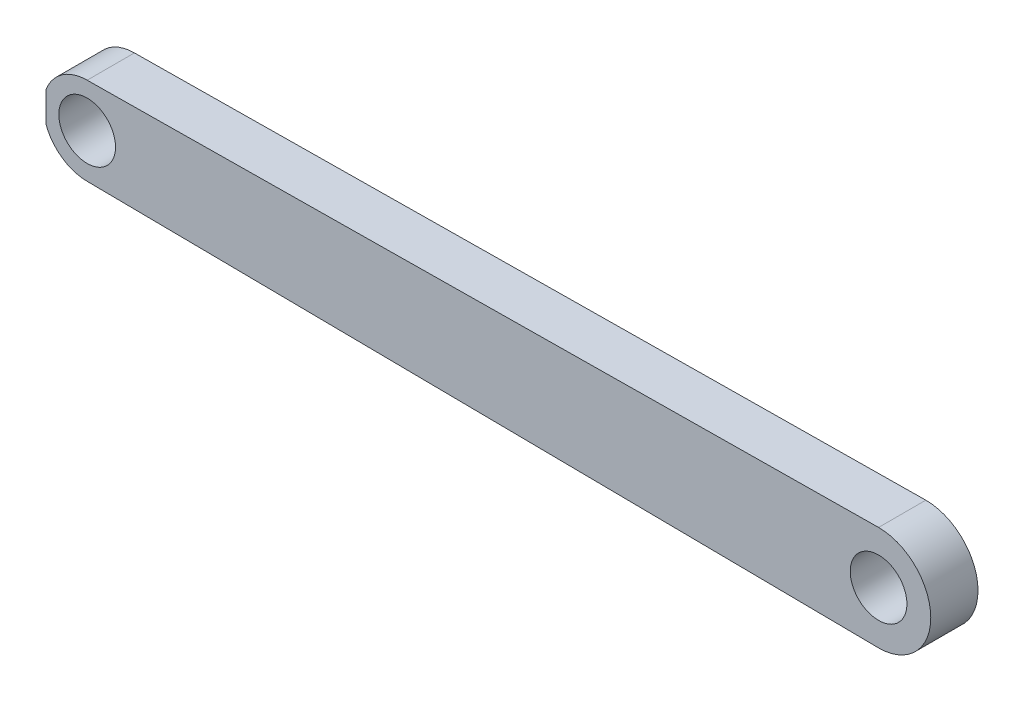
ISO-10303-21;
HEADER;
FILE_DESCRIPTION(('STEP AP214'),'2;1');
FILE_NAME('part.step','',(''),(''),'','','');
FILE_SCHEMA(('AUTOMOTIVE_DESIGN { 1 0 10303 214 1 1 1 1 }'));
ENDSEC;
DATA;
#1=APPLICATION_CONTEXT('core data for automotive mechanical design processes');
#2=APPLICATION_PROTOCOL_DEFINITION('international standard','automotive_design',2000,#1);
#3=PRODUCT_CONTEXT('',#1,'mechanical');
#4=PRODUCT('Part','Part','',(#3));
#5=PRODUCT_RELATED_PRODUCT_CATEGORY('part','',(#4));
#6=PRODUCT_DEFINITION_FORMATION('','',#4);
#7=PRODUCT_DEFINITION_CONTEXT('part definition',#1,'design');
#8=PRODUCT_DEFINITION('design','',#6,#7);
#9=PRODUCT_DEFINITION_SHAPE('','',#8);
#10=(LENGTH_UNIT() NAMED_UNIT(*) SI_UNIT(.MILLI.,.METRE.));
#11=(NAMED_UNIT(*) PLANE_ANGLE_UNIT() SI_UNIT($,.RADIAN.));
#12=(NAMED_UNIT(*) SI_UNIT($,.STERADIAN.) SOLID_ANGLE_UNIT());
#13=UNCERTAINTY_MEASURE_WITH_UNIT(LENGTH_MEASURE(1.E-05),#10,'distance_accuracy_value','');
#14=(GEOMETRIC_REPRESENTATION_CONTEXT(3) GLOBAL_UNCERTAINTY_ASSIGNED_CONTEXT((#13)) GLOBAL_UNIT_ASSIGNED_CONTEXT((#10,
#11,#12)) REPRESENTATION_CONTEXT('',''));
#15=CARTESIAN_POINT('',(0.,0.,0.));
#16=DIRECTION('',(0.,0.,1.));
#17=DIRECTION('',(1.,0.,0.));
#18=AXIS2_PLACEMENT_3D('',#15,#16,#17);
#19=CARTESIAN_POINT('',(0.,0.,5.));
#20=DIRECTION('',(0.,0.,-1.));
#21=DIRECTION('',(-1.,0.,0.));
#22=AXIS2_PLACEMENT_3D('',#19,#20,#21);
#23=CYLINDRICAL_SURFACE('',#22,4.63518821296482);
#24=DIRECTION('',(0.,0.,-1.));
#25=VECTOR('',#24,1.);
#26=CARTESIAN_POINT('',(-4.35681947691644,1.58211687784739,5.));
#27=LINE('',#26,#25);
#28=CARTESIAN_POINT('',(-4.35681947691644,1.58211687784739,5.));
#29=VERTEX_POINT('',#28);
#30=CARTESIAN_POINT('',(-4.35681947691644,1.58211687784739,0.));
#31=VERTEX_POINT('',#30);
#32=EDGE_CURVE('E51',#29,#31,#27,.T.);
#33=ORIENTED_EDGE('',*,*,#32,.F.);
#34=CARTESIAN_POINT('',(0.,0.,5.));
#35=DIRECTION('',(0.,0.,1.));
#36=DIRECTION('',(1.,0.,0.));
#37=AXIS2_PLACEMENT_3D('',#34,#35,#36);
#38=CIRCLE('',#37,4.63518821296482);
#39=CARTESIAN_POINT('',(0.,4.63518821296482,5.));
#40=VERTEX_POINT('',#39);
#41=EDGE_CURVE('E88',#40,#29,#38,.T.);
#42=ORIENTED_EDGE('',*,*,#41,.F.);
#43=DIRECTION('',(0.,0.,-1.));
#44=VECTOR('',#43,1.);
#45=CARTESIAN_POINT('',(0.,4.63518821296482,5.));
#46=LINE('',#45,#44);
#47=CARTESIAN_POINT('',(0.,4.63518821296482,0.));
#48=VERTEX_POINT('',#47);
#49=EDGE_CURVE('E45',#40,#48,#46,.T.);
#50=ORIENTED_EDGE('',*,*,#49,.T.);
#51=CARTESIAN_POINT('',(0.,0.,0.));
#52=DIRECTION('',(0.,0.,1.));
#53=DIRECTION('',(1.,0.,0.));
#54=AXIS2_PLACEMENT_3D('',#51,#52,#53);
#55=CIRCLE('',#54,4.63518821296482);
#56=EDGE_CURVE('E116',#48,#31,#55,.T.);
#57=ORIENTED_EDGE('',*,*,#56,.T.);
#58=EDGE_LOOP('',(#33,#42,#50,#57));
#59=FACE_BOUND('',#58,.T.);
#60=ADVANCED_FACE('F37',(#59),#23,.T.);
#61=DIRECTION('',(0.,0.,-1.));
#62=VECTOR('',#61,1.);
#63=CARTESIAN_POINT('',(-4.35681947691644,-1.58211687784739,5.));
#64=LINE('',#63,#62);
#65=CARTESIAN_POINT('',(-4.35681947691644,-1.58211687784739,0.));
#66=VERTEX_POINT('',#65);
#67=CARTESIAN_POINT('',(-4.35681947691644,-1.58211687784739,5.));
#68=VERTEX_POINT('',#67);
#69=EDGE_CURVE('E98',#66,#68,#64,.F.);
#70=ORIENTED_EDGE('',*,*,#69,.F.);
#71=CARTESIAN_POINT('',(0.,-4.63518821296482,0.));
#72=VERTEX_POINT('',#71);
#73=EDGE_CURVE('E107',#66,#72,#55,.T.);
#74=ORIENTED_EDGE('',*,*,#73,.T.);
#75=DIRECTION('',(0.,0.,-1.));
#76=VECTOR('',#75,1.);
#77=CARTESIAN_POINT('',(0.,-4.63518821296482,5.));
#78=LINE('',#77,#76);
#79=CARTESIAN_POINT('',(0.,-4.63518821296482,5.));
#80=VERTEX_POINT('',#79);
#81=EDGE_CURVE('E137',#80,#72,#78,.T.);
#82=ORIENTED_EDGE('',*,*,#81,.F.);
#83=EDGE_CURVE('E109',#68,#80,#38,.T.);
#84=ORIENTED_EDGE('',*,*,#83,.F.);
#85=EDGE_LOOP('',(#70,#74,#82,#84));
#86=FACE_BOUND('',#85,.T.);
#87=ADVANCED_FACE('F105',(#86),#23,.T.);
#88=CARTESIAN_POINT('',(0.,0.,5.));
#89=DIRECTION('',(0.,0.,1.));
#90=DIRECTION('',(1.,0.,0.));
#91=AXIS2_PLACEMENT_3D('',#88,#89,#90);
#92=PLANE('',#91);
#93=CARTESIAN_POINT('',(83.76241555,0.,5.));
#94=DIRECTION('',(0.,0.,1.));
#95=DIRECTION('',(1.,0.,0.));
#96=AXIS2_PLACEMENT_3D('',#93,#94,#95);
#97=CIRCLE('',#96,3.00000007924962);
#98=CARTESIAN_POINT('',(86.7624156292496,0.,5.));
#99=VERTEX_POINT('',#98);
#100=EDGE_CURVE('E147',#99,#99,#97,.T.);
#101=ORIENTED_EDGE('',*,*,#100,.F.);
#102=EDGE_LOOP('',(#101));
#103=FACE_BOUND('',#102,.T.);
#104=CARTESIAN_POINT('',(0.,0.,5.));
#105=DIRECTION('',(0.,0.,1.));
#106=DIRECTION('',(1.,0.,0.));
#107=AXIS2_PLACEMENT_3D('',#104,#105,#106);
#108=CIRCLE('',#107,3.00000007924961);
#109=CARTESIAN_POINT('',(3.00000007924961,0.,5.));
#110=VERTEX_POINT('',#109);
#111=EDGE_CURVE('E135',#110,#110,#108,.T.);
#112=ORIENTED_EDGE('',*,*,#111,.F.);
#113=EDGE_LOOP('',(#112));
#114=FACE_BOUND('',#113,.T.);
#115=ORIENTED_EDGE('',*,*,#41,.T.);
#116=DIRECTION('',(0.,1.,0.));
#117=VECTOR('',#116,1.);
#118=CARTESIAN_POINT('',(-4.35681947691644,0.,5.));
#119=LINE('',#118,#117);
#120=EDGE_CURVE('E110',#68,#29,#119,.T.);
#121=ORIENTED_EDGE('',*,*,#120,.F.);
#122=ORIENTED_EDGE('',*,*,#83,.T.);
#123=DIRECTION('',(-0.999943881550331,0.0105940431402313,0.));
#124=VECTOR('',#123,1.);
#125=CARTESIAN_POINT('',(-0.0491026281732267,-4.63466798840946,5.));
#126=LINE('',#125,#124);
#127=CARTESIAN_POINT('',(83.76241555,-5.52262065816452,5.));
#128=VERTEX_POINT('',#127);
#129=EDGE_CURVE('E145',#128,#80,#126,.T.);
#130=ORIENTED_EDGE('',*,*,#129,.F.);
#131=CARTESIAN_POINT('',(83.76241555,0.,5.));
#132=DIRECTION('',(0.,0.,1.));
#133=DIRECTION('',(1.,0.,0.));
#134=AXIS2_PLACEMENT_3D('',#131,#132,#133);
#135=CIRCLE('',#134,5.52262065816451);
#136=CARTESIAN_POINT('',(83.76241555,5.52262065816452,5.));
#137=VERTEX_POINT('',#136);
#138=EDGE_CURVE('E60',#128,#137,#135,.T.);
#139=ORIENTED_EDGE('',*,*,#138,.T.);
#140=DIRECTION('',(-0.999943881550331,-0.0105940431402313,0.));
#141=VECTOR('',#140,1.);
#142=CARTESIAN_POINT('',(-0.0491026281732267,4.63466798840946,5.));
#143=LINE('',#142,#141);
#144=EDGE_CURVE('E131',#137,#40,#143,.T.);
#145=ORIENTED_EDGE('',*,*,#144,.T.);
#146=EDGE_LOOP('',(#115,#121,#122,#130,#139,#145));
#147=FACE_BOUND('',#146,.T.);
#148=ADVANCED_FACE('F159',(#103,#114,#147),#92,.T.);
#149=CARTESIAN_POINT('',(0.,0.,0.));
#150=DIRECTION('',(0.,0.,1.));
#151=DIRECTION('',(1.,0.,0.));
#152=AXIS2_PLACEMENT_3D('',#149,#150,#151);
#153=PLANE('',#152);
#154=CARTESIAN_POINT('',(0.,0.,0.));
#155=DIRECTION('',(0.,0.,1.));
#156=DIRECTION('',(1.,0.,0.));
#157=AXIS2_PLACEMENT_3D('',#154,#155,#156);
#158=CIRCLE('',#157,3.00000007924961);
#159=CARTESIAN_POINT('',(3.00000007924961,0.,0.));
#160=VERTEX_POINT('',#159);
#161=EDGE_CURVE('E128',#160,#160,#158,.T.);
#162=ORIENTED_EDGE('',*,*,#161,.T.);
#163=EDGE_LOOP('',(#162));
#164=FACE_BOUND('',#163,.T.);
#165=CARTESIAN_POINT('',(83.76241555,0.,0.));
#166=DIRECTION('',(0.,0.,1.));
#167=DIRECTION('',(1.,0.,0.));
#168=AXIS2_PLACEMENT_3D('',#165,#166,#167);
#169=CIRCLE('',#168,3.00000007924962);
#170=CARTESIAN_POINT('',(86.7624156292496,0.,0.));
#171=VERTEX_POINT('',#170);
#172=EDGE_CURVE('E125',#171,#171,#169,.T.);
#173=ORIENTED_EDGE('',*,*,#172,.T.);
#174=EDGE_LOOP('',(#173));
#175=FACE_BOUND('',#174,.T.);
#176=DIRECTION('',(0.,-1.,0.));
#177=VECTOR('',#176,1.);
#178=CARTESIAN_POINT('',(-4.35681947691644,0.,0.));
#179=LINE('',#178,#177);
#180=EDGE_CURVE('E11',#31,#66,#179,.T.);
#181=ORIENTED_EDGE('',*,*,#180,.F.);
#182=ORIENTED_EDGE('',*,*,#56,.F.);
#183=DIRECTION('',(-0.999943881550331,-0.0105940431402313,0.));
#184=VECTOR('',#183,1.);
#185=CARTESIAN_POINT('',(-0.0491026281732267,4.63466798840946,0.));
#186=LINE('',#185,#184);
#187=CARTESIAN_POINT('',(83.76241555,5.52262065816452,0.));
#188=VERTEX_POINT('',#187);
#189=EDGE_CURVE('E117',#188,#48,#186,.T.);
#190=ORIENTED_EDGE('',*,*,#189,.F.);
#191=CARTESIAN_POINT('',(83.76241555,0.,0.));
#192=DIRECTION('',(0.,0.,1.));
#193=DIRECTION('',(1.,0.,0.));
#194=AXIS2_PLACEMENT_3D('',#191,#192,#193);
#195=CIRCLE('',#194,5.52262065816451);
#196=CARTESIAN_POINT('',(83.76241555,-5.52262065816452,0.));
#197=VERTEX_POINT('',#196);
#198=EDGE_CURVE('E81',#197,#188,#195,.T.);
#199=ORIENTED_EDGE('',*,*,#198,.F.);
#200=DIRECTION('',(-0.999943881550331,0.0105940431402313,0.));
#201=VECTOR('',#200,1.);
#202=CARTESIAN_POINT('',(-0.0491026281732267,-4.63466798840946,0.));
#203=LINE('',#202,#201);
#204=EDGE_CURVE('E115',#197,#72,#203,.T.);
#205=ORIENTED_EDGE('',*,*,#204,.T.);
#206=ORIENTED_EDGE('',*,*,#73,.F.);
#207=EDGE_LOOP('',(#181,#182,#190,#199,#205,#206));
#208=FACE_BOUND('',#207,.T.);
#209=ADVANCED_FACE('F113',(#164,#175,#208),#153,.F.);
#210=CARTESIAN_POINT('',(-0.0491026281732267,4.63466798840946,5.));
#211=DIRECTION('',(0.0105940431402313,-0.999943881550331,0.));
#212=DIRECTION('',(0.999943881550331,0.0105940431402313,0.));
#213=AXIS2_PLACEMENT_3D('',#210,#211,#212);
#214=PLANE('',#213);
#215=ORIENTED_EDGE('',*,*,#189,.T.);
#216=ORIENTED_EDGE('',*,*,#49,.F.);
#217=ORIENTED_EDGE('',*,*,#144,.F.);
#218=DIRECTION('',(0.,0.,-1.));
#219=VECTOR('',#218,1.);
#220=CARTESIAN_POINT('',(83.76241555,5.52262065816452,5.));
#221=LINE('',#220,#219);
#222=EDGE_CURVE('E132',#137,#188,#221,.T.);
#223=ORIENTED_EDGE('',*,*,#222,.T.);
#224=EDGE_LOOP('',(#215,#216,#217,#223));
#225=FACE_BOUND('',#224,.T.);
#226=ADVANCED_FACE('F39',(#225),#214,.F.);
#227=CARTESIAN_POINT('',(-0.0491026281732267,-4.63466798840946,5.));
#228=DIRECTION('',(-0.0105940431402313,-0.999943881550331,0.));
#229=DIRECTION('',(0.999943881550331,-0.0105940431402313,0.));
#230=AXIS2_PLACEMENT_3D('',#227,#228,#229);
#231=PLANE('',#230);
#232=ORIENTED_EDGE('',*,*,#204,.F.);
#233=DIRECTION('',(0.,0.,-1.));
#234=VECTOR('',#233,1.);
#235=CARTESIAN_POINT('',(83.76241555,-5.52262065816452,5.));
#236=LINE('',#235,#234);
#237=EDGE_CURVE('E134',#128,#197,#236,.T.);
#238=ORIENTED_EDGE('',*,*,#237,.F.);
#239=ORIENTED_EDGE('',*,*,#129,.T.);
#240=ORIENTED_EDGE('',*,*,#81,.T.);
#241=EDGE_LOOP('',(#232,#238,#239,#240));
#242=FACE_BOUND('',#241,.T.);
#243=ADVANCED_FACE('F143',(#242),#231,.T.);
#244=CARTESIAN_POINT('',(83.76241555,0.,5.));
#245=DIRECTION('',(0.,0.,-1.));
#246=DIRECTION('',(-1.,0.,0.));
#247=AXIS2_PLACEMENT_3D('',#244,#245,#246);
#248=CYLINDRICAL_SURFACE('',#247,3.00000007924962);
#249=ORIENTED_EDGE('',*,*,#100,.T.);
#250=EDGE_LOOP('',(#249));
#251=FACE_BOUND('',#250,.T.);
#252=ORIENTED_EDGE('',*,*,#172,.F.);
#253=EDGE_LOOP('',(#252));
#254=FACE_BOUND('',#253,.T.);
#255=ADVANCED_FACE('F179',(#251,#254),#248,.F.);
#256=CARTESIAN_POINT('',(83.76241555,0.,5.));
#257=DIRECTION('',(0.,0.,-1.));
#258=DIRECTION('',(-1.,0.,0.));
#259=AXIS2_PLACEMENT_3D('',#256,#257,#258);
#260=CYLINDRICAL_SURFACE('',#259,5.52262065816451);
#261=ORIENTED_EDGE('',*,*,#198,.T.);
#262=ORIENTED_EDGE('',*,*,#222,.F.);
#263=ORIENTED_EDGE('',*,*,#138,.F.);
#264=ORIENTED_EDGE('',*,*,#237,.T.);
#265=EDGE_LOOP('',(#261,#262,#263,#264));
#266=FACE_BOUND('',#265,.T.);
#267=ADVANCED_FACE('F180',(#266),#260,.T.);
#268=CARTESIAN_POINT('',(0.,0.,5.));
#269=DIRECTION('',(0.,0.,-1.));
#270=DIRECTION('',(-1.,0.,0.));
#271=AXIS2_PLACEMENT_3D('',#268,#269,#270);
#272=CYLINDRICAL_SURFACE('',#271,3.00000007924961);
#273=ORIENTED_EDGE('',*,*,#111,.T.);
#274=EDGE_LOOP('',(#273));
#275=FACE_BOUND('',#274,.T.);
#276=ORIENTED_EDGE('',*,*,#161,.F.);
#277=EDGE_LOOP('',(#276));
#278=FACE_BOUND('',#277,.T.);
#279=ADVANCED_FACE('F156',(#275,#278),#272,.F.);
#280=CARTESIAN_POINT('',(-4.35681947691644,0.,5.));
#281=DIRECTION('',(-1.,0.,0.));
#282=DIRECTION('',(0.,0.,1.));
#283=AXIS2_PLACEMENT_3D('',#280,#281,#282);
#284=PLANE('',#283);
#285=ORIENTED_EDGE('',*,*,#32,.T.);
#286=ORIENTED_EDGE('',*,*,#180,.T.);
#287=ORIENTED_EDGE('',*,*,#69,.T.);
#288=ORIENTED_EDGE('',*,*,#120,.T.);
#289=EDGE_LOOP('',(#285,#286,#287,#288));
#290=FACE_BOUND('',#289,.T.);
#291=ADVANCED_FACE('F97',(#290),#284,.T.);
#292=CLOSED_SHELL('',(#60,#87,#148,#209,#226,#243,#255,#267,#279,#291));
#293=MANIFOLD_SOLID_BREP('B2',#292);
#294=ADVANCED_BREP_SHAPE_REPRESENTATION('',(#18,#293),#14);
#295=SHAPE_DEFINITION_REPRESENTATION(#9,#294);
ENDSEC;
END-ISO-10303-21;
